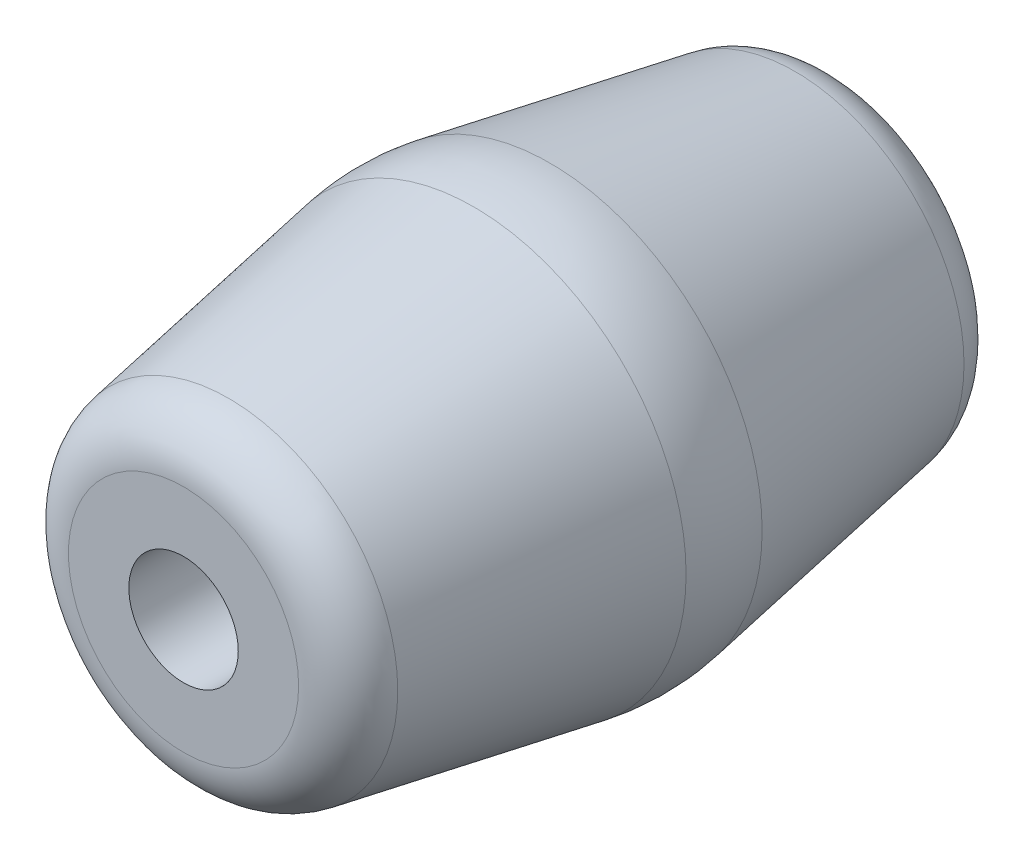
ISO-10303-21;
HEADER;
FILE_DESCRIPTION(('STEP AP214'),'2;1');
FILE_NAME('part.step','',(''),(''),'','','');
FILE_SCHEMA(('AUTOMOTIVE_DESIGN { 1 0 10303 214 1 1 1 1 }'));
ENDSEC;
DATA;
#1=APPLICATION_CONTEXT('core data for automotive mechanical design processes');
#2=APPLICATION_PROTOCOL_DEFINITION('international standard','automotive_design',2000,#1);
#3=PRODUCT_CONTEXT('',#1,'mechanical');
#4=PRODUCT('Part','Part','',(#3));
#5=PRODUCT_RELATED_PRODUCT_CATEGORY('part','',(#4));
#6=PRODUCT_DEFINITION_FORMATION('','',#4);
#7=PRODUCT_DEFINITION_CONTEXT('part definition',#1,'design');
#8=PRODUCT_DEFINITION('design','',#6,#7);
#9=PRODUCT_DEFINITION_SHAPE('','',#8);
#10=(LENGTH_UNIT() NAMED_UNIT(*) SI_UNIT(.MILLI.,.METRE.));
#11=(NAMED_UNIT(*) PLANE_ANGLE_UNIT() SI_UNIT($,.RADIAN.));
#12=(NAMED_UNIT(*) SI_UNIT($,.STERADIAN.) SOLID_ANGLE_UNIT());
#13=UNCERTAINTY_MEASURE_WITH_UNIT(LENGTH_MEASURE(1.E-05),#10,'distance_accuracy_value','');
#14=(GEOMETRIC_REPRESENTATION_CONTEXT(3) GLOBAL_UNCERTAINTY_ASSIGNED_CONTEXT((#13)) GLOBAL_UNIT_ASSIGNED_CONTEXT((#10,
#11,#12)) REPRESENTATION_CONTEXT('',''));
#15=CARTESIAN_POINT('',(0.,0.,0.));
#16=DIRECTION('',(0.,0.,1.));
#17=DIRECTION('',(1.,0.,0.));
#18=AXIS2_PLACEMENT_3D('',#15,#16,#17);
#19=CARTESIAN_POINT('',(0.,0.,0.));
#20=DIRECTION('',(0.,0.,-1.));
#21=DIRECTION('',(1.,0.,0.));
#22=AXIS2_PLACEMENT_3D('',#19,#20,#21);
#23=CONICAL_SURFACE('',#22,50.8,0.174532925199433);
#24=CARTESIAN_POINT('',(0.,0.,65.70533185637));
#25=DIRECTION('',(0.,0.,1.));
#26=DIRECTION('',(1.,0.,0.));
#27=AXIS2_PLACEMENT_3D('',#24,#25,#26);
#28=CIRCLE('',#27,39.2143772173185);
#29=CARTESIAN_POINT('',(39.2143772173185,0.,65.70533185637));
#30=VERTEX_POINT('',#29);
#31=EDGE_CURVE('E46',#30,#30,#28,.T.);
#32=ORIENTED_EDGE('',*,*,#31,.F.);
#33=EDGE_LOOP('',(#32));
#34=FACE_BOUND('',#33,.T.);
#35=CARTESIAN_POINT('',(0.,0.,8.82132742548008));
#36=DIRECTION('',(0.,0.,1.));
#37=DIRECTION('',(1.,0.,0.));
#38=AXIS2_PLACEMENT_3D('',#35,#36,#37);
#39=CIRCLE('',#38,49.2445619692243);
#40=CARTESIAN_POINT('',(49.2445619692243,0.,8.82132742548008));
#41=VERTEX_POINT('',#40);
#42=EDGE_CURVE('E59',#41,#41,#39,.F.);
#43=ORIENTED_EDGE('',*,*,#42,.F.);
#44=EDGE_LOOP('',(#43));
#45=FACE_BOUND('',#44,.T.);
#46=ADVANCED_FACE('F39',(#34,#45),#23,.T.);
#47=CARTESIAN_POINT('',(0.,0.,76.2));
#48=DIRECTION('',(0.,0.,-1.));
#49=DIRECTION('',(1.,0.,0.));
#50=AXIS2_PLACEMENT_3D('',#47,#48,#49);
#51=PLANE('',#50);
#52=CARTESIAN_POINT('',(0.,0.,76.2));
#53=DIRECTION('',(0.,0.,1.));
#54=DIRECTION('',(1.,0.,0.));
#55=AXIS2_PLACEMENT_3D('',#52,#53,#54);
#56=CIRCLE('',#55,26.7073187540635);
#57=CARTESIAN_POINT('',(26.7073187540635,0.,76.2));
#58=VERTEX_POINT('',#57);
#59=EDGE_CURVE('E10',#58,#58,#56,.F.);
#60=ORIENTED_EDGE('',*,*,#59,.F.);
#61=EDGE_LOOP('',(#60));
#62=FACE_BOUND('',#61,.T.);
#63=CARTESIAN_POINT('',(0.,0.,76.2));
#64=DIRECTION('',(0.,0.,1.));
#65=DIRECTION('',(1.,0.,0.));
#66=AXIS2_PLACEMENT_3D('',#63,#64,#65);
#67=CIRCLE('',#66,12.7);
#68=CARTESIAN_POINT('',(12.7,0.,76.2));
#69=VERTEX_POINT('',#68);
#70=EDGE_CURVE('E65',#69,#69,#67,.F.);
#71=ORIENTED_EDGE('',*,*,#70,.T.);
#72=EDGE_LOOP('',(#71));
#73=FACE_BOUND('',#72,.T.);
#74=ADVANCED_FACE('F91',(#62,#73),#51,.F.);
#75=CARTESIAN_POINT('',(0.,0.,0.));
#76=DIRECTION('',(0.,0.,1.));
#77=DIRECTION('',(1.,0.,0.));
#78=AXIS2_PLACEMENT_3D('',#75,#76,#77);
#79=CONICAL_SURFACE('',#78,50.8,0.174532925199433);
#80=CARTESIAN_POINT('',(0.,0.,-65.70533185637));
#81=DIRECTION('',(0.,0.,-1.));
#82=DIRECTION('',(-1.,0.,0.));
#83=AXIS2_PLACEMENT_3D('',#80,#81,#82);
#84=CIRCLE('',#83,39.2143772173185);
#85=CARTESIAN_POINT('',(-39.2143772173185,0.,-65.70533185637));
#86=VERTEX_POINT('',#85);
#87=EDGE_CURVE('E50',#86,#86,#84,.T.);
#88=ORIENTED_EDGE('',*,*,#87,.F.);
#89=EDGE_LOOP('',(#88));
#90=FACE_BOUND('',#89,.T.);
#91=CARTESIAN_POINT('',(0.,0.,-8.82132742548008));
#92=DIRECTION('',(0.,0.,-1.));
#93=DIRECTION('',(-1.,0.,0.));
#94=AXIS2_PLACEMENT_3D('',#91,#92,#93);
#95=CIRCLE('',#94,49.2445619692243);
#96=CARTESIAN_POINT('',(-49.2445619692243,0.,-8.82132742548008));
#97=VERTEX_POINT('',#96);
#98=EDGE_CURVE('E62',#97,#97,#95,.F.);
#99=ORIENTED_EDGE('',*,*,#98,.F.);
#100=EDGE_LOOP('',(#99));
#101=FACE_BOUND('',#100,.T.);
#102=ADVANCED_FACE('F86',(#90,#101),#79,.T.);
#103=CARTESIAN_POINT('',(0.,0.,-76.2));
#104=DIRECTION('',(0.,0.,-1.));
#105=DIRECTION('',(1.,0.,0.));
#106=AXIS2_PLACEMENT_3D('',#103,#104,#105);
#107=PLANE('',#106);
#108=CARTESIAN_POINT('',(0.,0.,-76.2));
#109=DIRECTION('',(0.,0.,1.));
#110=DIRECTION('',(1.,0.,0.));
#111=AXIS2_PLACEMENT_3D('',#108,#109,#110);
#112=CIRCLE('',#111,26.7073187540635);
#113=CARTESIAN_POINT('',(26.7073187540635,0.,-76.2));
#114=VERTEX_POINT('',#113);
#115=EDGE_CURVE('E54',#114,#114,#112,.T.);
#116=ORIENTED_EDGE('',*,*,#115,.F.);
#117=EDGE_LOOP('',(#116));
#118=FACE_BOUND('',#117,.T.);
#119=CARTESIAN_POINT('',(0.,0.,-76.2));
#120=DIRECTION('',(0.,0.,1.));
#121=DIRECTION('',(1.,0.,0.));
#122=AXIS2_PLACEMENT_3D('',#119,#120,#121);
#123=CIRCLE('',#122,12.7);
#124=CARTESIAN_POINT('',(12.7,0.,-76.2));
#125=VERTEX_POINT('',#124);
#126=EDGE_CURVE('E68',#125,#125,#123,.T.);
#127=ORIENTED_EDGE('',*,*,#126,.T.);
#128=EDGE_LOOP('',(#127));
#129=FACE_BOUND('',#128,.T.);
#130=ADVANCED_FACE('F72',(#118,#129),#107,.T.);
#131=CARTESIAN_POINT('',(0.,0.,112.121024484277));
#132=DIRECTION('',(0.,0.,-1.));
#133=DIRECTION('',(1.,0.,0.));
#134=AXIS2_PLACEMENT_3D('',#131,#132,#133);
#135=CYLINDRICAL_SURFACE('',#134,12.7);
#136=ORIENTED_EDGE('',*,*,#70,.F.);
#137=EDGE_LOOP('',(#136));
#138=FACE_BOUND('',#137,.T.);
#139=ORIENTED_EDGE('',*,*,#126,.F.);
#140=EDGE_LOOP('',(#139));
#141=FACE_BOUND('',#140,.T.);
#142=ADVANCED_FACE('F74',(#138,#141),#135,.F.);
#143=CARTESIAN_POINT('',(0.,0.,0.));
#144=DIRECTION('',(0.,0.,1.));
#145=DIRECTION('',(-1.,0.,0.));
#146=AXIS2_PLACEMENT_3D('',#143,#144,#145);
#147=DEGENERATE_TOROIDAL_SURFACE('',#146,0.783671883795842,50.8,.F.);
#148=ORIENTED_EDGE('',*,*,#42,.T.);
#149=EDGE_LOOP('',(#148));
#150=FACE_BOUND('',#149,.T.);
#151=ORIENTED_EDGE('',*,*,#98,.T.);
#152=EDGE_LOOP('',(#151));
#153=FACE_BOUND('',#152,.T.);
#154=ADVANCED_FACE('F76',(#150,#153),#147,.F.);
#155=CARTESIAN_POINT('',(0.,0.,-63.5));
#156=DIRECTION('',(0.,0.,-1.));
#157=DIRECTION('',(1.,0.,0.));
#158=AXIS2_PLACEMENT_3D('',#155,#156,#157);
#159=TOROIDAL_SURFACE('',#158,26.7073187540635,12.7);
#160=ORIENTED_EDGE('',*,*,#87,.T.);
#161=EDGE_LOOP('',(#160));
#162=FACE_BOUND('',#161,.T.);
#163=ORIENTED_EDGE('',*,*,#115,.T.);
#164=EDGE_LOOP('',(#163));
#165=FACE_BOUND('',#164,.T.);
#166=ADVANCED_FACE('F83',(#162,#165),#159,.T.);
#167=CARTESIAN_POINT('',(0.,0.,63.5));
#168=DIRECTION('',(0.,0.,-1.));
#169=DIRECTION('',(1.,0.,0.));
#170=AXIS2_PLACEMENT_3D('',#167,#168,#169);
#171=TOROIDAL_SURFACE('',#170,26.7073187540635,12.7);
#172=ORIENTED_EDGE('',*,*,#59,.T.);
#173=EDGE_LOOP('',(#172));
#174=FACE_BOUND('',#173,.T.);
#175=ORIENTED_EDGE('',*,*,#31,.T.);
#176=EDGE_LOOP('',(#175));
#177=FACE_BOUND('',#176,.T.);
#178=ADVANCED_FACE('F41',(#174,#177),#171,.T.);
#179=CLOSED_SHELL('',(#46,#74,#102,#130,#142,#154,#166,#178));
#180=MANIFOLD_SOLID_BREP('B2',#179);
#181=ADVANCED_BREP_SHAPE_REPRESENTATION('',(#18,#180),#14);
#182=SHAPE_DEFINITION_REPRESENTATION(#9,#181);
ENDSEC;
END-ISO-10303-21;
